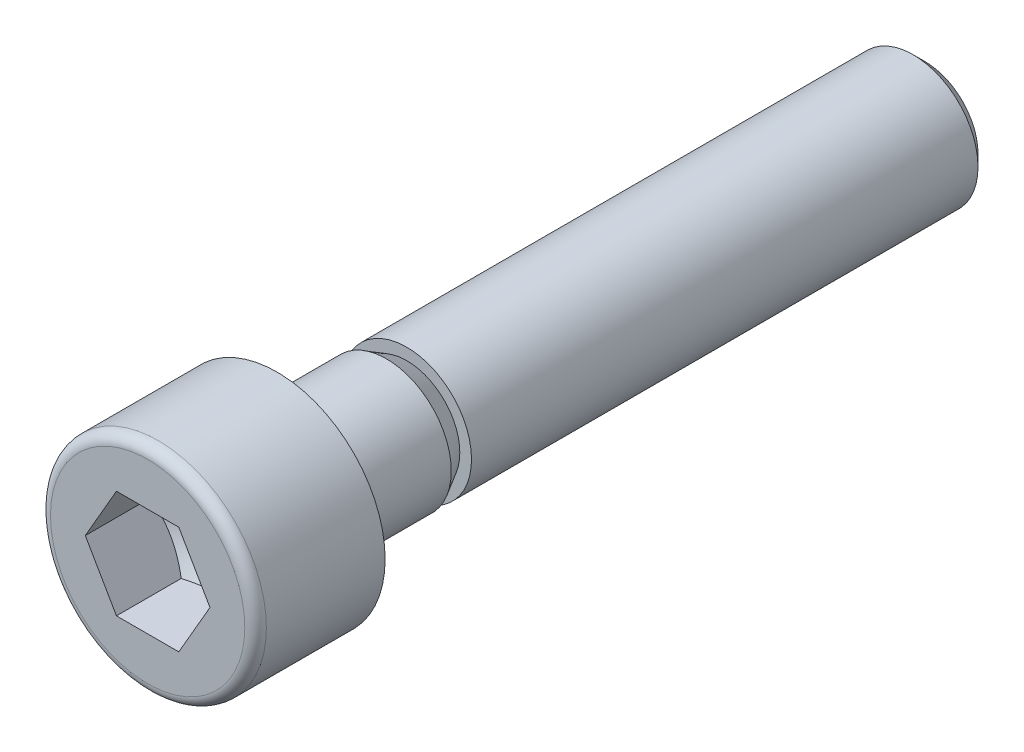
ISO-10303-21;
HEADER;
FILE_DESCRIPTION(('STEP AP214'),'2;1');
FILE_NAME('part.step','',(''),(''),'','','');
FILE_SCHEMA(('AUTOMOTIVE_DESIGN { 1 0 10303 214 1 1 1 1 }'));
ENDSEC;
DATA;
#1=APPLICATION_CONTEXT('core data for automotive mechanical design processes');
#2=APPLICATION_PROTOCOL_DEFINITION('international standard','automotive_design',2000,#1);
#3=PRODUCT_CONTEXT('',#1,'mechanical');
#4=PRODUCT('Part','Part','',(#3));
#5=PRODUCT_RELATED_PRODUCT_CATEGORY('part','',(#4));
#6=PRODUCT_DEFINITION_FORMATION('','',#4);
#7=PRODUCT_DEFINITION_CONTEXT('part definition',#1,'design');
#8=PRODUCT_DEFINITION('design','',#6,#7);
#9=PRODUCT_DEFINITION_SHAPE('','',#8);
#10=(LENGTH_UNIT() NAMED_UNIT(*) SI_UNIT(.MILLI.,.METRE.));
#11=(NAMED_UNIT(*) PLANE_ANGLE_UNIT() SI_UNIT($,.RADIAN.));
#12=(NAMED_UNIT(*) SI_UNIT($,.STERADIAN.) SOLID_ANGLE_UNIT());
#13=UNCERTAINTY_MEASURE_WITH_UNIT(LENGTH_MEASURE(1.E-05),#10,'distance_accuracy_value','');
#14=(GEOMETRIC_REPRESENTATION_CONTEXT(3) GLOBAL_UNCERTAINTY_ASSIGNED_CONTEXT((#13)) GLOBAL_UNIT_ASSIGNED_CONTEXT((#10,
#11,#12)) REPRESENTATION_CONTEXT('',''));
#15=CARTESIAN_POINT('',(0.,0.,0.));
#16=DIRECTION('',(0.,0.,1.));
#17=DIRECTION('',(1.,0.,0.));
#18=AXIS2_PLACEMENT_3D('',#15,#16,#17);
#19=CARTESIAN_POINT('',(0.,0.,5.99999999999999));
#20=DIRECTION('',(0.,0.,1.));
#21=DIRECTION('',(1.,0.,0.));
#22=AXIS2_PLACEMENT_3D('',#19,#20,#21);
#23=PLANE('',#22);
#24=CARTESIAN_POINT('',(0.,0.,5.99999999999999));
#25=DIRECTION('',(0.,0.,1.));
#26=DIRECTION('',(1.,0.,0.));
#27=AXIS2_PLACEMENT_3D('',#24,#25,#26);
#28=CIRCLE('',#27,4.5);
#29=CARTESIAN_POINT('',(4.50000000000001,0.,5.99999999999999));
#30=VERTEX_POINT('',#29);
#31=EDGE_CURVE('E11',#30,#30,#28,.T.);
#32=ORIENTED_EDGE('',*,*,#31,.T.);
#33=EDGE_LOOP('',(#32));
#34=FACE_BOUND('',#33,.T.);
#35=DIRECTION('',(1.,0.,0.));
#36=VECTOR('',#35,1.);
#37=CARTESIAN_POINT('',(-1.44337499999994,2.49999883437468,5.99999999999999));
#38=LINE('',#37,#36);
#39=CARTESIAN_POINT('',(-1.44337499999994,2.49999883437468,5.99999999999999));
#40=VERTEX_POINT('',#39);
#41=CARTESIAN_POINT('',(1.44337500000019,2.49999883437475,6.00000000000001));
#42=VERTEX_POINT('',#41);
#43=EDGE_CURVE('E94',#40,#42,#38,.T.);
#44=ORIENTED_EDGE('',*,*,#43,.T.);
#45=DIRECTION('',(0.500000000000001,-0.866025403784439,0.));
#46=VECTOR('',#45,1.);
#47=CARTESIAN_POINT('',(1.44337500000019,2.49999883437475,6.00000000000001));
#48=LINE('',#47,#46);
#49=CARTESIAN_POINT('',(2.88674999999999,0.,6.00000000000001));
#50=VERTEX_POINT('',#49);
#51=EDGE_CURVE('E31',#42,#50,#48,.T.);
#52=ORIENTED_EDGE('',*,*,#51,.T.);
#53=DIRECTION('',(-0.500000000000001,-0.866025403784438,0.));
#54=VECTOR('',#53,1.);
#55=CARTESIAN_POINT('',(2.88674999999999,0.,6.00000000000001));
#56=LINE('',#55,#54);
#57=CARTESIAN_POINT('',(1.44337499999994,-2.49999883437468,6.00000000000002));
#58=VERTEX_POINT('',#57);
#59=EDGE_CURVE('E193',#50,#58,#56,.T.);
#60=ORIENTED_EDGE('',*,*,#59,.T.);
#61=DIRECTION('',(-1.,0.,0.));
#62=VECTOR('',#61,1.);
#63=CARTESIAN_POINT('',(1.44337499999994,-2.49999883437468,6.00000000000002));
#64=LINE('',#63,#62);
#65=CARTESIAN_POINT('',(-1.443375,-2.49999883437473,6.00000000000002));
#66=VERTEX_POINT('',#65);
#67=EDGE_CURVE('E186',#58,#66,#64,.T.);
#68=ORIENTED_EDGE('',*,*,#67,.T.);
#69=DIRECTION('',(-0.500000000000001,0.866025403784439,0.));
#70=VECTOR('',#69,1.);
#71=CARTESIAN_POINT('',(-1.443375,-2.49999883437473,6.00000000000002));
#72=LINE('',#71,#70);
#73=CARTESIAN_POINT('',(-2.88674999999999,0.,6.00000000000001));
#74=VERTEX_POINT('',#73);
#75=EDGE_CURVE('E181',#66,#74,#72,.T.);
#76=ORIENTED_EDGE('',*,*,#75,.T.);
#77=DIRECTION('',(0.500000000000001,0.866025403784438,0.));
#78=VECTOR('',#77,1.);
#79=CARTESIAN_POINT('',(-2.88674999999999,0.,6.00000000000001));
#80=LINE('',#79,#78);
#81=EDGE_CURVE('E102',#74,#40,#80,.T.);
#82=ORIENTED_EDGE('',*,*,#81,.T.);
#83=EDGE_LOOP('',(#44,#52,#60,#68,#76,#82));
#84=FACE_BOUND('',#83,.T.);
#85=ADVANCED_FACE('F16',(#34,#84),#23,.T.);
#86=CARTESIAN_POINT('',(-1.11022302462516E-13,0.,5.50000000000003));
#87=DIRECTION('',(0.,0.,1.));
#88=DIRECTION('',(1.,0.,0.));
#89=AXIS2_PLACEMENT_3D('',#86,#87,#88);
#90=TOROIDAL_SURFACE('',#89,4.5,0.5);
#91=ORIENTED_EDGE('',*,*,#31,.F.);
#92=EDGE_LOOP('',(#91));
#93=FACE_BOUND('',#92,.T.);
#94=CARTESIAN_POINT('',(-1.11022302462516E-13,0.,5.50000000000003));
#95=DIRECTION('',(0.,0.,1.));
#96=DIRECTION('',(1.,0.,0.));
#97=AXIS2_PLACEMENT_3D('',#94,#95,#96);
#98=CIRCLE('',#97,5.);
#99=CARTESIAN_POINT('',(4.9999999999999,0.,5.50000000000003));
#100=VERTEX_POINT('',#99);
#101=EDGE_CURVE('E24',#100,#100,#98,.T.);
#102=ORIENTED_EDGE('',*,*,#101,.T.);
#103=EDGE_LOOP('',(#102));
#104=FACE_BOUND('',#103,.T.);
#105=ADVANCED_FACE('F153',(#93,#104),#90,.T.);
#106=CARTESIAN_POINT('',(0.,0.,5.99999999999999));
#107=DIRECTION('',(0.,0.,1.));
#108=DIRECTION('',(1.,0.,0.));
#109=AXIS2_PLACEMENT_3D('',#106,#107,#108);
#110=CYLINDRICAL_SURFACE('',#109,5.);
#111=CARTESIAN_POINT('',(0.,0.,0.));
#112=DIRECTION('',(0.,0.,1.));
#113=DIRECTION('',(1.,0.,0.));
#114=AXIS2_PLACEMENT_3D('',#111,#112,#113);
#115=CIRCLE('',#114,5.);
#116=CARTESIAN_POINT('',(5.00000000000001,0.,0.));
#117=VERTEX_POINT('',#116);
#118=EDGE_CURVE('E145',#117,#117,#115,.T.);
#119=ORIENTED_EDGE('',*,*,#118,.T.);
#120=EDGE_LOOP('',(#119));
#121=FACE_BOUND('',#120,.T.);
#122=ORIENTED_EDGE('',*,*,#101,.F.);
#123=EDGE_LOOP('',(#122));
#124=FACE_BOUND('',#123,.T.);
#125=ADVANCED_FACE('F155',(#121,#124),#110,.T.);
#126=CARTESIAN_POINT('',(1.11022302462516E-13,5.00000000000009,0.));
#127=DIRECTION('',(0.,0.,-1.));
#128=DIRECTION('',(-1.,0.,0.));
#129=AXIS2_PLACEMENT_3D('',#126,#127,#128);
#130=PLANE('',#129);
#131=CARTESIAN_POINT('',(0.,0.,0.));
#132=DIRECTION('',(0.,0.,1.));
#133=DIRECTION('',(1.,0.,0.));
#134=AXIS2_PLACEMENT_3D('',#131,#132,#133);
#135=CIRCLE('',#134,3.3);
#136=CARTESIAN_POINT('',(3.30000000000001,0.,0.));
#137=VERTEX_POINT('',#136);
#138=EDGE_CURVE('E141',#137,#137,#135,.T.);
#139=ORIENTED_EDGE('',*,*,#138,.T.);
#140=EDGE_LOOP('',(#139));
#141=FACE_BOUND('',#140,.T.);
#142=ORIENTED_EDGE('',*,*,#118,.F.);
#143=EDGE_LOOP('',(#142));
#144=FACE_BOUND('',#143,.T.);
#145=ADVANCED_FACE('F157',(#141,#144),#130,.T.);
#146=CARTESIAN_POINT('',(-1.11022302462516E-13,0.,-0.299999999999953));
#147=DIRECTION('',(0.,0.,1.));
#148=DIRECTION('',(1.,0.,0.));
#149=AXIS2_PLACEMENT_3D('',#146,#147,#148);
#150=TOROIDAL_SURFACE('',#149,3.3,0.3);
#151=CARTESIAN_POINT('',(-1.11022302462516E-13,0.,-0.299999999999953));
#152=DIRECTION('',(0.,0.,1.));
#153=DIRECTION('',(1.,0.,0.));
#154=AXIS2_PLACEMENT_3D('',#151,#152,#153);
#155=CIRCLE('',#154,3.);
#156=CARTESIAN_POINT('',(2.9999999999999,0.,-0.299999999999953));
#157=VERTEX_POINT('',#156);
#158=EDGE_CURVE('E137',#157,#157,#155,.T.);
#159=ORIENTED_EDGE('',*,*,#158,.T.);
#160=EDGE_LOOP('',(#159));
#161=FACE_BOUND('',#160,.T.);
#162=ORIENTED_EDGE('',*,*,#138,.F.);
#163=EDGE_LOOP('',(#162));
#164=FACE_BOUND('',#163,.T.);
#165=ADVANCED_FACE('F165',(#161,#164),#150,.F.);
#166=CARTESIAN_POINT('',(0.,0.,5.99999999999999));
#167=DIRECTION('',(0.,0.,1.));
#168=DIRECTION('',(1.,0.,0.));
#169=AXIS2_PLACEMENT_3D('',#166,#167,#168);
#170=CYLINDRICAL_SURFACE('',#169,3.);
#171=CARTESIAN_POINT('',(0.,-1.11022302462516E-13,-5.06252750040329));
#172=DIRECTION('',(0.,0.,1.));
#173=DIRECTION('',(1.,0.,0.));
#174=AXIS2_PLACEMENT_3D('',#171,#172,#173);
#175=CIRCLE('',#174,3.);
#176=CARTESIAN_POINT('',(3.00000000000006,-1.13197645701391E-13,-5.06252750040329));
#177=VERTEX_POINT('',#176);
#178=EDGE_CURVE('E133',#177,#177,#175,.T.);
#179=ORIENTED_EDGE('',*,*,#178,.T.);
#180=EDGE_LOOP('',(#179));
#181=FACE_BOUND('',#180,.T.);
#182=ORIENTED_EDGE('',*,*,#158,.F.);
#183=EDGE_LOOP('',(#182));
#184=FACE_BOUND('',#183,.T.);
#185=ADVANCED_FACE('F394',(#181,#184),#170,.T.);
#186=CARTESIAN_POINT('',(0.,-1.11022302462516E-13,-5.06252750040329));
#187=DIRECTION('',(0.,0.,1.));
#188=DIRECTION('',(1.,0.,0.));
#189=AXIS2_PLACEMENT_3D('',#186,#187,#188);
#190=CONICAL_SURFACE('',#189,3.,0.523598775598299);
#191=CARTESIAN_POINT('',(0.,0.,-6.00000000000002));
#192=DIRECTION('',(0.,0.,1.));
#193=DIRECTION('',(1.,0.,0.));
#194=AXIS2_PLACEMENT_3D('',#191,#192,#193);
#195=CIRCLE('',#194,2.45875);
#196=CARTESIAN_POINT('',(2.45875000000001,0.,-6.00000000000002));
#197=VERTEX_POINT('',#196);
#198=EDGE_CURVE('E129',#197,#197,#195,.T.);
#199=ORIENTED_EDGE('',*,*,#198,.T.);
#200=EDGE_LOOP('',(#199));
#201=FACE_BOUND('',#200,.T.);
#202=ORIENTED_EDGE('',*,*,#178,.F.);
#203=EDGE_LOOP('',(#202));
#204=FACE_BOUND('',#203,.T.);
#205=ADVANCED_FACE('F383',(#201,#204),#190,.T.);
#206=CARTESIAN_POINT('',(0.,2.45874999999999,-5.99999999999999));
#207=DIRECTION('',(0.,0.,1.));
#208=DIRECTION('',(1.,0.,0.));
#209=AXIS2_PLACEMENT_3D('',#206,#207,#208);
#210=PLANE('',#209);
#211=CARTESIAN_POINT('',(0.,0.,-6.00000000000002));
#212=DIRECTION('',(0.,0.,1.));
#213=DIRECTION('',(1.,0.,0.));
#214=AXIS2_PLACEMENT_3D('',#211,#212,#213);
#215=CIRCLE('',#214,3.);
#216=CARTESIAN_POINT('',(3.00000000000001,0.,-6.00000000000002));
#217=VERTEX_POINT('',#216);
#218=EDGE_CURVE('E125',#217,#217,#215,.T.);
#219=ORIENTED_EDGE('',*,*,#218,.T.);
#220=EDGE_LOOP('',(#219));
#221=FACE_BOUND('',#220,.T.);
#222=ORIENTED_EDGE('',*,*,#198,.F.);
#223=EDGE_LOOP('',(#222));
#224=FACE_BOUND('',#223,.T.);
#225=ADVANCED_FACE('F370',(#221,#224),#210,.T.);
#226=CARTESIAN_POINT('',(0.,0.,5.99999999999999));
#227=DIRECTION('',(0.,0.,1.));
#228=DIRECTION('',(1.,0.,0.));
#229=AXIS2_PLACEMENT_3D('',#226,#227,#228);
#230=CYLINDRICAL_SURFACE('',#229,3.);
#231=CARTESIAN_POINT('',(0.,0.,-29.4587500000001));
#232=DIRECTION('',(0.,0.,1.));
#233=DIRECTION('',(1.,0.,0.));
#234=AXIS2_PLACEMENT_3D('',#231,#232,#233);
#235=CIRCLE('',#234,3.);
#236=CARTESIAN_POINT('',(3.00000000000001,0.,-29.4587500000001));
#237=VERTEX_POINT('',#236);
#238=EDGE_CURVE('E121',#237,#237,#235,.T.);
#239=ORIENTED_EDGE('',*,*,#238,.T.);
#240=EDGE_LOOP('',(#239));
#241=FACE_BOUND('',#240,.T.);
#242=ORIENTED_EDGE('',*,*,#218,.F.);
#243=EDGE_LOOP('',(#242));
#244=FACE_BOUND('',#243,.T.);
#245=ADVANCED_FACE('F358',(#241,#244),#230,.T.);
#246=CARTESIAN_POINT('',(0.,0.,-29.4587500000001));
#247=DIRECTION('',(0.,0.,1.));
#248=DIRECTION('',(1.,0.,0.));
#249=AXIS2_PLACEMENT_3D('',#246,#247,#248);
#250=CONICAL_SURFACE('',#249,3.,0.78539816339745);
#251=CARTESIAN_POINT('',(0.,1.38777878078145E-13,-30.));
#252=DIRECTION('',(0.,0.,1.));
#253=DIRECTION('',(1.,0.,0.));
#254=AXIS2_PLACEMENT_3D('',#251,#252,#253);
#255=CIRCLE('',#254,2.45875);
#256=CARTESIAN_POINT('',(2.45874999999998,1.36995003015283E-13,-30.));
#257=VERTEX_POINT('',#256);
#258=EDGE_CURVE('E117',#257,#257,#255,.T.);
#259=ORIENTED_EDGE('',*,*,#258,.T.);
#260=EDGE_LOOP('',(#259));
#261=FACE_BOUND('',#260,.T.);
#262=ORIENTED_EDGE('',*,*,#238,.F.);
#263=EDGE_LOOP('',(#262));
#264=FACE_BOUND('',#263,.T.);
#265=ADVANCED_FACE('F348',(#261,#264),#250,.T.);
#266=CARTESIAN_POINT('',(0.,2.45875000000013,-30.));
#267=DIRECTION('',(0.,0.,-1.));
#268=DIRECTION('',(-1.,0.,0.));
#269=AXIS2_PLACEMENT_3D('',#266,#267,#268);
#270=PLANE('',#269);
#271=ORIENTED_EDGE('',*,*,#258,.F.);
#272=EDGE_LOOP('',(#271));
#273=FACE_BOUND('',#272,.T.);
#274=ADVANCED_FACE('F257',(#273),#270,.T.);
#275=CARTESIAN_POINT('',(1.44337500000008,2.4999988343748,1.33333411041692));
#276=DIRECTION('',(-0.86602540378444,-0.5,0.));
#277=DIRECTION('',(-0.500000000000001,0.866025403784438,0.));
#278=AXIS2_PLACEMENT_3D('',#275,#276,#277);
#279=PLANE('',#278);
#280=DIRECTION('',(0.,0.,1.));
#281=VECTOR('',#280,1.);
#282=CARTESIAN_POINT('',(2.88674999999999,1.73472347597681E-13,1.33333411041668));
#283=LINE('',#282,#281);
#284=CARTESIAN_POINT('',(2.88674999999983,1.38777878078145E-13,2.99999999999988));
#285=VERTEX_POINT('',#284);
#286=EDGE_CURVE('E114',#285,#50,#283,.T.);
#287=ORIENTED_EDGE('',*,*,#286,.T.);
#288=ORIENTED_EDGE('',*,*,#51,.F.);
#289=DIRECTION('',(0.,0.,1.));
#290=VECTOR('',#289,1.);
#291=CARTESIAN_POINT('',(1.44337500000008,2.4999988343748,1.33333411041692));
#292=LINE('',#291,#290);
#293=CARTESIAN_POINT('',(1.443375,2.4999988343748,2.99999999999989));
#294=VERTEX_POINT('',#293);
#295=EDGE_CURVE('E87',#294,#42,#292,.T.);
#296=ORIENTED_EDGE('',*,*,#295,.F.);
#297=CARTESIAN_POINT('',(2.88675011546996,-1.99999905525772E-07,3.00000006666661));
#298=CARTESIAN_POINT('',(2.82332252366578,0.109859611606839,2.96336950967835));
#299=CARTESIAN_POINT('',(2.75934742579574,0.220667731537013,2.93005593436164));
#300=CARTESIAN_POINT('',(2.6302895438713,0.444202540147451,2.87190808727679));
#301=CARTESIAN_POINT('',(2.56520446745336,0.5569331993178,2.84709438377085));
#302=CARTESIAN_POINT('',(2.43584088140159,0.780997503008738,2.80847006268851));
#303=CARTESIAN_POINT('',(2.37158227044586,0.892296682007818,2.79440234892012));
#304=CARTESIAN_POINT('',(2.24276284805617,1.11541846658857,2.77761157054628));
#305=CARTESIAN_POINT('',(2.17820250452497,1.22724026173888,2.77487459839359));
#306=CARTESIAN_POINT('',(2.0575784132837,1.43616731638556,2.78058295689794));
#307=CARTESIAN_POINT('',(2.00149656500919,1.53330392697922,2.78762669633233));
#308=CARTESIAN_POINT('',(1.88969822343411,1.72694433478908,2.80994670830964));
#309=CARTESIAN_POINT('',(1.83398211652597,1.82344746275397,2.82523059787354));
#310=CARTESIAN_POINT('',(1.72195345954667,2.01748678854586,2.86343736615357));
#311=CARTESIAN_POINT('',(1.66565508107198,2.11499844044777,2.88652212541093));
#312=CARTESIAN_POINT('',(1.55389777191145,2.30856777803094,2.93891477048989));
#313=CARTESIAN_POINT('',(1.49843741058812,2.40462794164905,2.96821035401513));
#314=CARTESIAN_POINT('',(1.44337488452992,2.49999903437489,3.00000006666654));
#315=B_SPLINE_CURVE_WITH_KNOTS('',3,(#297,#298,#299,#300,#301,#302,#303,#304,#305,#306,#307,
#308,#309,#310,#311,#312,#313,#314),.UNSPECIFIED.,.F.,.F.,(4,2,2,2,2,2,2,2,4),(0.,
0.396269845497124,0.793491933375077,1.18088400346177,1.5678004406215,1.90463400294071,
2.24177946228522,2.58640119548569,2.93034658115078),.UNSPECIFIED.);
#316=EDGE_CURVE('E79',#285,#294,#315,.T.);
#317=ORIENTED_EDGE('',*,*,#316,.F.);
#318=EDGE_LOOP('',(#287,#288,#296,#317));
#319=FACE_BOUND('',#318,.T.);
#320=ADVANCED_FACE('F88',(#319),#279,.T.);
#321=CARTESIAN_POINT('',(2.88674999999999,1.73472347597681E-13,1.33333411041668));
#322=DIRECTION('',(-0.866025403784441,0.5,0.));
#323=DIRECTION('',(0.500000000000001,0.866025403784438,0.));
#324=AXIS2_PLACEMENT_3D('',#321,#322,#323);
#325=PLANE('',#324);
#326=DIRECTION('',(0.,0.,1.));
#327=VECTOR('',#326,1.);
#328=CARTESIAN_POINT('',(1.44337500000008,-2.49999883437463,1.33333411041693));
#329=LINE('',#328,#327);
#330=CARTESIAN_POINT('',(1.44337499999997,-2.49999883437459,2.99999999999988));
#331=VERTEX_POINT('',#330);
#332=EDGE_CURVE('E111',#331,#58,#329,.T.);
#333=ORIENTED_EDGE('',*,*,#332,.T.);
#334=ORIENTED_EDGE('',*,*,#59,.F.);
#335=ORIENTED_EDGE('',*,*,#286,.F.);
#336=CARTESIAN_POINT('',(1.44337488452995,-2.4999990343747,3.00000006666656));
#337=CARTESIAN_POINT('',(1.50680247633416,-2.39013922276797,2.96336950967824));
#338=CARTESIAN_POINT('',(1.57077757420422,-2.27933110283779,2.93005593436151));
#339=CARTESIAN_POINT('',(1.69983545612869,-2.05579629422734,2.87190808727666));
#340=CARTESIAN_POINT('',(1.76492053254663,-1.94306563505698,2.84709438377071));
#341=CARTESIAN_POINT('',(1.89428411859841,-1.71900133136602,2.80847006268835));
#342=CARTESIAN_POINT('',(1.95854272955413,-1.60770215236693,2.79440234891994));
#343=CARTESIAN_POINT('',(2.08736215194386,-1.38458036778617,2.77761157054616));
#344=CARTESIAN_POINT('',(2.1519224954751,-1.27275857263586,2.77487459839357));
#345=CARTESIAN_POINT('',(2.27254658671637,-1.06383151798917,2.78058295689791));
#346=CARTESIAN_POINT('',(2.32862843499085,-0.966694907395494,2.78762669633222));
#347=CARTESIAN_POINT('',(2.44042677656589,-0.773054499585641,2.80994670830948));
#348=CARTESIAN_POINT('',(2.49614288347403,-0.676551371620775,2.8252305978734));
#349=CARTESIAN_POINT('',(2.60817154045333,-0.482512045828913,2.86343736615344));
#350=CARTESIAN_POINT('',(2.66446991892802,-0.385000393927017,2.88652212541079));
#351=CARTESIAN_POINT('',(2.77622722808851,-0.191431056343864,2.93891477048976));
#352=CARTESIAN_POINT('',(2.83168758941181,-0.0953708927257628,2.96821035401503));
#353=CARTESIAN_POINT('',(2.88675011546996,2.00000078998119E-07,3.00000006666654));
#354=B_SPLINE_CURVE_WITH_KNOTS('',3,(#336,#337,#338,#339,#340,#341,#342,#343,#344,#345,#346,
#347,#348,#349,#350,#351,#352,#353),.UNSPECIFIED.,.F.,.F.,(4,2,2,2,2,2,2,2,4),(0.,
0.396269845497181,0.793491933375164,1.18088400346189,1.56780044062167,1.90463400294085,
2.24177946228531,2.58640119548574,2.9303465811508),.UNSPECIFIED.);
#355=EDGE_CURVE('E83',#331,#285,#354,.T.);
#356=ORIENTED_EDGE('',*,*,#355,.F.);
#357=EDGE_LOOP('',(#333,#334,#335,#356));
#358=FACE_BOUND('',#357,.T.);
#359=ADVANCED_FACE('F248',(#358),#325,.T.);
#360=CARTESIAN_POINT('',(1.44337500000008,-2.49999883437463,1.33333411041693));
#361=DIRECTION('',(0.,1.,0.));
#362=DIRECTION('',(1.,0.,0.));
#363=AXIS2_PLACEMENT_3D('',#360,#361,#362);
#364=PLANE('',#363);
#365=DIRECTION('',(0.,0.,1.));
#366=VECTOR('',#365,1.);
#367=CARTESIAN_POINT('',(-1.44337499999997,-2.4999988343746,1.3333341104169));
#368=LINE('',#367,#366);
#369=CARTESIAN_POINT('',(-1.44337500000002,-2.49999883437463,3.00000000000009));
#370=VERTEX_POINT('',#369);
#371=EDGE_CURVE('E108',#370,#66,#368,.T.);
#372=ORIENTED_EDGE('',*,*,#371,.T.);
#373=ORIENTED_EDGE('',*,*,#67,.F.);
#374=ORIENTED_EDGE('',*,*,#332,.F.);
#375=CARTESIAN_POINT('',(-3.73786106214971,-2.49999883437452,3.92958778907326));
#376=CARTESIAN_POINT('',(-3.62896491195933,-2.49999883437459,3.87734398831159));
#377=CARTESIAN_POINT('',(-3.51980131110668,-2.49999883437462,3.82564701620669));
#378=CARTESIAN_POINT('',(-3.30079453275693,-2.49999883437464,3.72366066581963));
#379=CARTESIAN_POINT('',(-3.19095123199837,-2.49999883437463,3.6733715525608));
#380=CARTESIAN_POINT('',(-2.96980741137605,-2.49999883437463,3.5742326617255));
#381=CARTESIAN_POINT('',(-2.8585020885178,-2.49999883437463,3.52539355708358));
#382=CARTESIAN_POINT('',(-2.6349453306619,-2.49999883437463,3.42993961665009));
#383=CARTESIAN_POINT('',(-2.52269394848718,-2.49999883437463,3.38332465762951));
#384=CARTESIAN_POINT('',(-2.29607962287522,-2.49999883437463,3.29252281771903));
#385=CARTESIAN_POINT('',(-2.1817068139253,-2.49999883437463,3.24836041683649));
#386=CARTESIAN_POINT('',(-1.95158478593385,-2.49999883437463,3.16370836718419));
#387=CARTESIAN_POINT('',(-1.83583541308946,-2.49999883437464,3.12321913326025));
#388=CARTESIAN_POINT('',(-1.60304799958045,-2.49999883437462,3.04706130714343));
#389=CARTESIAN_POINT('',(-1.48601365444337,-2.4999988343746,3.01138153954987));
#390=CARTESIAN_POINT('',(-1.25028155584977,-2.49999883437466,2.94604587235115));
#391=CARTESIAN_POINT('',(-1.13158421230436,-2.49999883437473,2.91638851527052));
#392=CARTESIAN_POINT('',(-0.892146141983676,-2.49999883437473,2.86451911091832));
#393=CARTESIAN_POINT('',(-0.771400115486122,-2.49999883437465,2.84233105195637));
#394=CARTESIAN_POINT('',(-0.528550538127009,-2.4999988343746,2.80705675484136));
#395=CARTESIAN_POINT('',(-0.406446967923706,-2.49999883437463,2.79397064653857));
#396=CARTESIAN_POINT('',(-0.162227421037293,-2.49999883437463,2.77805851853025));
#397=CARTESIAN_POINT('',(-0.0401151733531773,-2.4999988343746,2.77517671003704));
#398=CARTESIAN_POINT('',(0.203885891243289,-2.49999883437466,2.7797895987152));
#399=CARTESIAN_POINT('',(0.325774751512647,-2.49999883437476,2.78728200631533));
#400=CARTESIAN_POINT('',(0.536617165080526,-2.49999883437473,2.80870547357714));
#401=CARTESIAN_POINT('',(0.625806204585284,-2.49999883437466,2.82042640123085));
#402=CARTESIAN_POINT('',(0.803437024790607,-2.4999988343746,2.84861382064687));
#403=CARTESIAN_POINT('',(0.891878680031756,-2.49999883437462,2.86508109348134));
#404=CARTESIAN_POINT('',(1.15624928073783,-2.49999883437465,2.92077504184744));
#405=CARTESIAN_POINT('',(1.33087080697452,-2.49999883437463,2.96625356320289));
#406=CARTESIAN_POINT('',(1.59190160301469,-2.49999883437463,3.04393162478609));
#407=CARTESIAN_POINT('',(1.67969059973094,-2.49999883437463,3.0717495689676));
#408=CARTESIAN_POINT('',(1.85442096143945,-2.49999883437463,3.12997740734102));
#409=CARTESIAN_POINT('',(1.94136225311567,-2.49999883437463,3.16038752354638));
#410=CARTESIAN_POINT('',(2.11396102501557,-2.49999883437463,3.22316216485985));
#411=CARTESIAN_POINT('',(2.19962301770646,-2.49999883437463,3.25551440549189));
#412=CARTESIAN_POINT('',(2.37023194830676,-2.49999883437462,3.32197432045096));
#413=CARTESIAN_POINT('',(2.45517911361758,-2.49999883437461,3.35608140990558));
#414=CARTESIAN_POINT('',(2.5398274528195,-2.49999883437457,3.39089882482811));
#415=B_SPLINE_CURVE_WITH_KNOTS('',3,(#375,#376,#377,#378,#379,#380,#381,#382,#383,#384,#385,
#386,#387,#388,#389,#390,#391,#392,#393,#394,#395,#396,#397,#398,#399,#400,#401,#402,#403,#404,
#405,#406,#407,#408,#409,#410,#411,#412,#413,#414),.UNSPECIFIED.,.F.,.F.,(4,2,2,2,2,2,2,2,2,2,2,
2,2,2,2,2,2,2,2,4),(0.,0.362345077461339,0.724757912306425,1.08938530048727,1.45399246293529,
1.82175226930546,2.18955355872741,2.55648491480021,2.92332736420006,3.29133696448619,
3.65935181476389,4.02535152666685,4.39127047595123,4.66100477488141,4.93078348742951,
5.47140222651038,5.74765583222634,6.02393312223638,6.2986168800365,6.573209674333),.UNSPECIFIED.);
#416=EDGE_CURVE('E237',#370,#331,#415,.T.);
#417=ORIENTED_EDGE('',*,*,#416,.F.);
#418=EDGE_LOOP('',(#372,#373,#374,#417));
#419=FACE_BOUND('',#418,.T.);
#420=ADVANCED_FACE('F244',(#419),#364,.T.);
#421=CARTESIAN_POINT('',(-1.44337499999997,-2.4999988343746,1.3333341104169));
#422=DIRECTION('',(0.866025403784441,0.499999999999999,0.));
#423=DIRECTION('',(0.500000000000001,-0.866025403784439,0.));
#424=AXIS2_PLACEMENT_3D('',#421,#422,#423);
#425=PLANE('',#424);
#426=DIRECTION('',(0.,0.,1.));
#427=VECTOR('',#426,1.);
#428=CARTESIAN_POINT('',(-2.8867500000001,0.,1.33333411041693));
#429=LINE('',#428,#427);
#430=CARTESIAN_POINT('',(-2.8867500000001,1.45716771982052E-13,3.00000000000011));
#431=VERTEX_POINT('',#430);
#432=EDGE_CURVE('E100',#431,#74,#429,.T.);
#433=ORIENTED_EDGE('',*,*,#432,.T.);
#434=ORIENTED_EDGE('',*,*,#75,.F.);
#435=ORIENTED_EDGE('',*,*,#371,.F.);
#436=CARTESIAN_POINT('',(-2.88675011547007,2.00000210837104E-07,3.00000006666677));
#437=CARTESIAN_POINT('',(-2.82332252366583,-0.109859611606484,2.96336950967834));
#438=CARTESIAN_POINT('',(-2.75934742579575,-0.22066773153664,2.93005593436156));
#439=CARTESIAN_POINT('',(-2.63028954387126,-0.444202540147071,2.87190808727666));
#440=CARTESIAN_POINT('',(-2.56520446745332,-0.556933199317432,2.84709438377072));
#441=CARTESIAN_POINT('',(-2.43584088140157,-0.780997503008406,2.80847006268834));
#442=CARTESIAN_POINT('',(-2.37158227044588,-0.892296682007511,2.79440234891989));
#443=CARTESIAN_POINT('',(-2.24276284805607,-1.11541846658822,2.77761157054614));
#444=CARTESIAN_POINT('',(-2.17820250452472,-1.22724026173846,2.77487459839358));
#445=CARTESIAN_POINT('',(-2.05757841328345,-1.43616731638518,2.78058295689789));
#446=CARTESIAN_POINT('',(-2.00149656500907,-1.53330392697893,2.78762669633215));
#447=CARTESIAN_POINT('',(-1.88969822343408,-1.72694433478885,2.80994670830937));
#448=CARTESIAN_POINT('',(-1.83398211652591,-1.82344746275371,2.8252305978733));
#449=CARTESIAN_POINT('',(-1.72195345954657,-2.01748678854559,2.86343736615333));
#450=CARTESIAN_POINT('',(-1.66565508107187,-2.11499844044751,2.88652212541065));
#451=CARTESIAN_POINT('',(-1.55389777191139,-2.30856777803069,2.93891477048969));
#452=CARTESIAN_POINT('',(-1.49843741058811,-2.40462794164881,2.96821035401504));
#453=CARTESIAN_POINT('',(-1.44337488453,-2.49999903437464,3.00000006666676));
#454=B_SPLINE_CURVE_WITH_KNOTS('',3,(#436,#437,#438,#439,#440,#441,#442,#443,#444,#445,#446,
#447,#448,#449,#450,#451,#452,#453),.UNSPECIFIED.,.F.,.F.,(4,2,2,2,2,2,2,2,4),(0.,
0.396269845497203,0.793491933375185,1.1808840034619,1.56780044062168,1.90463400294091,
2.24177946228541,2.58640119548588,2.93034658115102),.UNSPECIFIED.);
#455=EDGE_CURVE('E231',#431,#370,#454,.T.);
#456=ORIENTED_EDGE('',*,*,#455,.F.);
#457=EDGE_LOOP('',(#433,#434,#435,#456));
#458=FACE_BOUND('',#457,.T.);
#459=ADVANCED_FACE('F247',(#458),#425,.T.);
#460=CARTESIAN_POINT('',(-2.8867500000001,0.,1.33333411041693));
#461=DIRECTION('',(0.866025403784441,-0.5,0.));
#462=DIRECTION('',(-0.500000000000001,-0.866025403784438,0.));
#463=AXIS2_PLACEMENT_3D('',#460,#461,#462);
#464=PLANE('',#463);
#465=DIRECTION('',(0.,0.,1.));
#466=VECTOR('',#465,1.);
#467=CARTESIAN_POINT('',(-1.44337499999991,2.49999883437499,1.3333341104169));
#468=LINE('',#467,#466);
#469=CARTESIAN_POINT('',(-1.44337500000011,2.49999883437488,3.0000000000001));
#470=VERTEX_POINT('',#469);
#471=EDGE_CURVE('E93',#470,#40,#468,.T.);
#472=ORIENTED_EDGE('',*,*,#471,.T.);
#473=ORIENTED_EDGE('',*,*,#81,.F.);
#474=ORIENTED_EDGE('',*,*,#432,.F.);
#475=CARTESIAN_POINT('',(-1.44337488453009,2.4999990343749,3.00000006666677));
#476=CARTESIAN_POINT('',(-1.50680247633428,2.39013922276817,2.96336950967843));
#477=CARTESIAN_POINT('',(-1.57077757420434,2.279331102838,2.93005593436168));
#478=CARTESIAN_POINT('',(-1.69983545612882,2.05579629422756,2.8719080872768));
#479=CARTESIAN_POINT('',(-1.76492053254676,1.94306563505721,2.84709438377085));
#480=CARTESIAN_POINT('',(-1.89428411859851,1.71900133136624,2.80847006268849));
#481=CARTESIAN_POINT('',(-1.9585427295542,1.60770215236714,2.79440234892008));
#482=CARTESIAN_POINT('',(-2.087362151944,1.38458036778644,2.77761157054625));
#483=CARTESIAN_POINT('',(-2.15192249547533,1.2727585726362,2.7748745983936));
#484=CARTESIAN_POINT('',(-2.27254658671659,1.06383151798949,2.78058295689793));
#485=CARTESIAN_POINT('',(-2.32862843499098,0.966694907395757,2.78762669633228));
#486=CARTESIAN_POINT('',(-2.44042677656597,0.773054499585845,2.80994670830956));
#487=CARTESIAN_POINT('',(-2.49614288347414,0.676551371620981,2.82523059787346));
#488=CARTESIAN_POINT('',(-2.60817154045348,0.4825120458291,2.86343736615347));
#489=CARTESIAN_POINT('',(-2.66446991892818,0.385000393927184,2.88652212541081));
#490=CARTESIAN_POINT('',(-2.77622722808866,0.191431056343995,2.93891477048982));
#491=CARTESIAN_POINT('',(-2.83168758941195,0.0953708927258799,2.96821035401514));
#492=CARTESIAN_POINT('',(-2.88675011547007,-1.99999961036923E-07,3.00000006666677));
#493=B_SPLINE_CURVE_WITH_KNOTS('',3,(#475,#476,#477,#478,#479,#480,#481,#482,#483,#484,#485,
#486,#487,#488,#489,#490,#491,#492),.UNSPECIFIED.,.F.,.F.,(4,2,2,2,2,2,2,2,4),(0.,
0.396269845497171,0.793491933375153,1.18088400346186,1.56780044062162,1.90463400294083,
2.24177946228533,2.58640119548581,2.93034658115093),.UNSPECIFIED.);
#494=EDGE_CURVE('E39',#470,#431,#493,.T.);
#495=ORIENTED_EDGE('',*,*,#494,.F.);
#496=EDGE_LOOP('',(#472,#473,#474,#495));
#497=FACE_BOUND('',#496,.T.);
#498=ADVANCED_FACE('F179',(#497),#464,.T.);
#499=CARTESIAN_POINT('',(-1.44337499999991,2.49999883437499,1.3333341104169));
#500=DIRECTION('',(0.,-1.,0.));
#501=DIRECTION('',(-1.,0.,0.));
#502=AXIS2_PLACEMENT_3D('',#499,#500,#501);
#503=PLANE('',#502);
#504=ORIENTED_EDGE('',*,*,#295,.T.);
#505=ORIENTED_EDGE('',*,*,#43,.F.);
#506=ORIENTED_EDGE('',*,*,#471,.F.);
#507=CARTESIAN_POINT('',(-3.73786106214974,2.49999883437483,3.92958778907326));
#508=CARTESIAN_POINT('',(-3.62896491195932,2.49999883437493,3.87734398831169));
#509=CARTESIAN_POINT('',(-3.51980131110665,2.49999883437497,3.82564701620683));
#510=CARTESIAN_POINT('',(-3.3007945327569,2.499998834375,3.7236606658198));
#511=CARTESIAN_POINT('',(-3.19095123199835,2.49999883437499,3.67337155256096));
#512=CARTESIAN_POINT('',(-2.96980741137602,2.49999883437498,3.57423266172566));
#513=CARTESIAN_POINT('',(-2.85850208851776,2.49999883437499,3.52539355708374));
#514=CARTESIAN_POINT('',(-2.63494533066184,2.49999883437499,3.42993961665025));
#515=CARTESIAN_POINT('',(-2.52269394848712,2.49999883437499,3.38332465762967));
#516=CARTESIAN_POINT('',(-2.29607962287514,2.49999883437499,3.2925228177192));
#517=CARTESIAN_POINT('',(-2.18170681392521,2.49999883437499,3.24836041683667));
#518=CARTESIAN_POINT('',(-1.95158478593375,2.49999883437499,3.16370836718437));
#519=CARTESIAN_POINT('',(-1.83583541308935,2.49999883437498,3.12321913326041));
#520=CARTESIAN_POINT('',(-1.60304799958032,2.499998834375,3.04706130714364));
#521=CARTESIAN_POINT('',(-1.48601365444323,2.49999883437504,3.01138153955013));
#522=CARTESIAN_POINT('',(-1.25028155584966,2.49999883437494,2.9460458723513));
#523=CARTESIAN_POINT('',(-1.13158421230429,2.49999883437479,2.91638851527051));
#524=CARTESIAN_POINT('',(-0.892146141983638,2.4999988343748,2.86451911091833));
#525=CARTESIAN_POINT('',(-0.771400115486065,2.49999883437494,2.84233105195656));
#526=CARTESIAN_POINT('',(-0.52855053812695,2.49999883437504,2.80705675484168));
#527=CARTESIAN_POINT('',(-0.406446967923661,2.499998834375,2.79397064653884));
#528=CARTESIAN_POINT('',(-0.162227421037275,2.49999883437499,2.77805851853053));
#529=CARTESIAN_POINT('',(-0.0401151733531698,2.49999883437502,2.7751767100374));
#530=CARTESIAN_POINT('',(0.203885891243286,2.49999883437496,2.7797895987154));
#531=CARTESIAN_POINT('',(0.325774751512644,2.49999883437486,2.7872820063153));
#532=CARTESIAN_POINT('',(0.536617165080483,2.49999883437489,2.80870547357716));
#533=CARTESIAN_POINT('',(0.625806204585211,2.49999883437496,2.82042640123105));
#534=CARTESIAN_POINT('',(0.803437024790506,2.49999883437502,2.84861382064718));
#535=CARTESIAN_POINT('',(0.891878680031657,2.499998834375,2.86508109348161));
#536=CARTESIAN_POINT('',(1.15624928073774,2.49999883437497,2.92077504184762));
#537=CARTESIAN_POINT('',(1.33087080697443,2.49999883437499,2.9662535632031));
#538=CARTESIAN_POINT('',(1.59190160301462,2.499998834375,3.04393162478631));
#539=CARTESIAN_POINT('',(1.67969059973088,2.499998834375,3.07174956896782));
#540=CARTESIAN_POINT('',(1.8544209614394,2.49999883437499,3.12997740734122));
#541=CARTESIAN_POINT('',(1.94136225311563,2.49999883437499,3.16038752354658));
#542=CARTESIAN_POINT('',(2.11396102501554,2.499998834375,3.22316216486006));
#543=CARTESIAN_POINT('',(2.19962301770641,2.49999883437501,3.2555144054921));
#544=CARTESIAN_POINT('',(2.37023194830671,2.49999883437498,3.32197432045113));
#545=CARTESIAN_POINT('',(2.45517911361754,2.49999883437492,3.35608140990571));
#546=CARTESIAN_POINT('',(2.5398274528195,2.49999883437479,3.39089882482813));
#547=B_SPLINE_CURVE_WITH_KNOTS('',3,(#507,#508,#509,#510,#511,#512,#513,#514,#515,#516,#517,
#518,#519,#520,#521,#522,#523,#524,#525,#526,#527,#528,#529,#530,#531,#532,#533,#534,#535,#536,
#537,#538,#539,#540,#541,#542,#543,#544,#545,#546),.UNSPECIFIED.,.F.,.F.,(4,2,2,2,2,2,2,2,2,2,2,
2,2,2,2,2,2,2,2,4),(0.,0.36234507746132,0.724757912306394,1.08938530048727,1.45399246293531,
1.8217522693055,2.18955355872747,2.55648491480027,2.92332736420009,3.29133696448618,
3.65935181476386,4.02535152666679,4.39127047595112,4.66100477488127,4.93078348742936,
5.47140222651024,5.74765583222622,6.02393312223629,6.29861688003639,6.57320967433286),.UNSPECIFIED.);
#548=EDGE_CURVE('E80',#294,#470,#547,.F.);
#549=ORIENTED_EDGE('',*,*,#548,.F.);
#550=EDGE_LOOP('',(#504,#505,#506,#549));
#551=FACE_BOUND('',#550,.T.);
#552=ADVANCED_FACE('F75',(#551),#503,.T.);
#553=CARTESIAN_POINT('',(0.,0.,1.33333411041692));
#554=DIRECTION('',(0.,0.,1.));
#555=DIRECTION('',(1.,0.,0.));
#556=AXIS2_PLACEMENT_3D('',#553,#554,#555);
#557=CONICAL_SURFACE('',#556,0.,1.0471975511966);
#558=CARTESIAN_POINT('',(0.,0.,1.33333411041692));
#559=VERTEX_POINT('',#558);
#560=VERTEX_LOOP('',#559);
#561=FACE_BOUND('',#560,.T.);
#562=ORIENTED_EDGE('',*,*,#316,.T.);
#563=ORIENTED_EDGE('',*,*,#548,.T.);
#564=ORIENTED_EDGE('',*,*,#494,.T.);
#565=ORIENTED_EDGE('',*,*,#455,.T.);
#566=ORIENTED_EDGE('',*,*,#416,.T.);
#567=ORIENTED_EDGE('',*,*,#355,.T.);
#568=EDGE_LOOP('',(#562,#563,#564,#565,#566,#567));
#569=FACE_BOUND('',#568,.T.);
#570=ADVANCED_FACE('F72',(#561,#569),#557,.F.);
#571=CLOSED_SHELL('',(#85,#105,#125,#145,#165,#185,#205,#225,#245,#265,#274,#320,#359,#420,#459,
#498,#552,#570));
#572=MANIFOLD_SOLID_BREP('B1',#571);
#573=ADVANCED_BREP_SHAPE_REPRESENTATION('',(#18,#572),#14);
#574=SHAPE_DEFINITION_REPRESENTATION(#9,#573);
ENDSEC;
END-ISO-10303-21;
